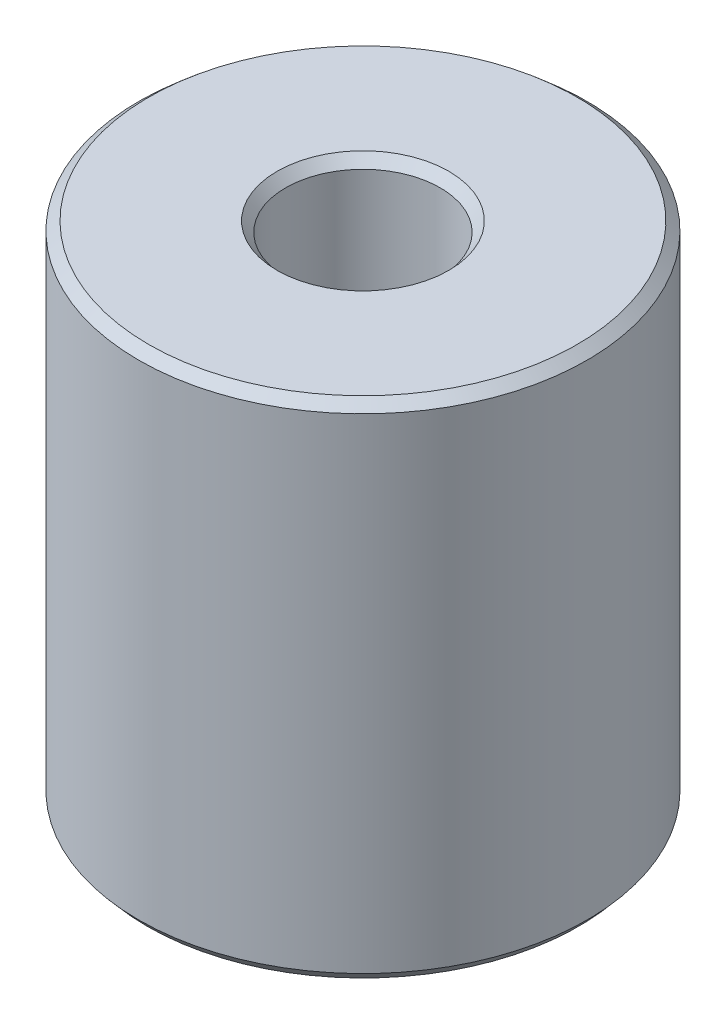
ISO-10303-21;
HEADER;
FILE_DESCRIPTION(('STEP AP214'),'2;1');
FILE_NAME('part.step','',(''),(''),'','','');
FILE_SCHEMA(('AUTOMOTIVE_DESIGN { 1 0 10303 214 1 1 1 1 }'));
ENDSEC;
DATA;
#1=APPLICATION_CONTEXT('core data for automotive mechanical design processes');
#2=APPLICATION_PROTOCOL_DEFINITION('international standard','automotive_design',2000,#1);
#3=PRODUCT_CONTEXT('',#1,'mechanical');
#4=PRODUCT('Part','Part','',(#3));
#5=PRODUCT_RELATED_PRODUCT_CATEGORY('part','',(#4));
#6=PRODUCT_DEFINITION_FORMATION('','',#4);
#7=PRODUCT_DEFINITION_CONTEXT('part definition',#1,'design');
#8=PRODUCT_DEFINITION('design','',#6,#7);
#9=PRODUCT_DEFINITION_SHAPE('','',#8);
#10=(LENGTH_UNIT() NAMED_UNIT(*) SI_UNIT(.MILLI.,.METRE.));
#11=(NAMED_UNIT(*) PLANE_ANGLE_UNIT() SI_UNIT($,.RADIAN.));
#12=(NAMED_UNIT(*) SI_UNIT($,.STERADIAN.) SOLID_ANGLE_UNIT());
#13=UNCERTAINTY_MEASURE_WITH_UNIT(LENGTH_MEASURE(1.E-05),#10,'distance_accuracy_value','');
#14=(GEOMETRIC_REPRESENTATION_CONTEXT(3) GLOBAL_UNCERTAINTY_ASSIGNED_CONTEXT((#13)) GLOBAL_UNIT_ASSIGNED_CONTEXT((#10,
#11,#12)) REPRESENTATION_CONTEXT('',''));
#15=CARTESIAN_POINT('',(0.,0.,0.));
#16=DIRECTION('',(0.,0.,1.));
#17=DIRECTION('',(1.,0.,0.));
#18=AXIS2_PLACEMENT_3D('',#15,#16,#17);
#19=CARTESIAN_POINT('',(0.,16.8402044351258,0.));
#20=DIRECTION('',(0.,-1.,0.));
#21=DIRECTION('',(0.,0.,-1.));
#22=AXIS2_PLACEMENT_3D('',#19,#20,#21);
#23=CYLINDRICAL_SURFACE('',#22,7.5);
#24=CARTESIAN_POINT('',(0.,0.332812918078715,0.));
#25=DIRECTION('',(0.,1.,0.));
#26=DIRECTION('',(0.,0.,1.));
#27=AXIS2_PLACEMENT_3D('',#24,#25,#26);
#28=CIRCLE('',#27,7.5);
#29=CARTESIAN_POINT('',(0.,0.332812918078715,7.5));
#30=VERTEX_POINT('',#29);
#31=EDGE_CURVE('E10',#30,#30,#28,.T.);
#32=ORIENTED_EDGE('',*,*,#31,.T.);
#33=EDGE_LOOP('',(#32));
#34=FACE_BOUND('',#33,.T.);
#35=CARTESIAN_POINT('',(0.,16.5516726464599,0.));
#36=DIRECTION('',(0.,1.,0.));
#37=DIRECTION('',(0.,0.,1.));
#38=AXIS2_PLACEMENT_3D('',#35,#36,#37);
#39=CIRCLE('',#38,7.5);
#40=CARTESIAN_POINT('',(0.,16.5516726464599,7.5));
#41=VERTEX_POINT('',#40);
#42=EDGE_CURVE('E50',#41,#41,#39,.F.);
#43=ORIENTED_EDGE('',*,*,#42,.T.);
#44=EDGE_LOOP('',(#43));
#45=FACE_BOUND('',#44,.T.);
#46=ADVANCED_FACE('F39',(#34,#45),#23,.T.);
#47=CARTESIAN_POINT('',(0.,16.8402044351258,0.));
#48=DIRECTION('',(0.,1.,0.));
#49=DIRECTION('',(0.,0.,1.));
#50=AXIS2_PLACEMENT_3D('',#47,#48,#49);
#51=PLANE('',#50);
#52=CARTESIAN_POINT('',(0.,16.8402044351258,0.));
#53=DIRECTION('',(0.,1.,0.));
#54=DIRECTION('',(0.,0.,1.));
#55=AXIS2_PLACEMENT_3D('',#52,#53,#54);
#56=CIRCLE('',#55,2.87287557769245);
#57=CARTESIAN_POINT('',(0.,16.8402044351258,2.87287557769245));
#58=VERTEX_POINT('',#57);
#59=EDGE_CURVE('E58',#58,#58,#56,.F.);
#60=ORIENTED_EDGE('',*,*,#59,.T.);
#61=EDGE_LOOP('',(#60));
#62=FACE_BOUND('',#61,.T.);
#63=CARTESIAN_POINT('',(0.,16.8402044351258,0.));
#64=DIRECTION('',(0.,1.,0.));
#65=DIRECTION('',(0.,0.,1.));
#66=AXIS2_PLACEMENT_3D('',#63,#64,#65);
#67=CIRCLE('',#66,7.16718708192129);
#68=CARTESIAN_POINT('',(0.,16.8402044351258,7.16718708192129));
#69=VERTEX_POINT('',#68);
#70=EDGE_CURVE('E61',#69,#69,#67,.T.);
#71=ORIENTED_EDGE('',*,*,#70,.T.);
#72=EDGE_LOOP('',(#71));
#73=FACE_BOUND('',#72,.T.);
#74=ADVANCED_FACE('F88',(#62,#73),#51,.T.);
#75=CARTESIAN_POINT('',(0.,0.,0.));
#76=DIRECTION('',(0.,1.,0.));
#77=DIRECTION('',(0.,0.,1.));
#78=AXIS2_PLACEMENT_3D('',#75,#76,#77);
#79=PLANE('',#78);
#80=CARTESIAN_POINT('',(0.,0.,0.));
#81=DIRECTION('',(0.,1.,0.));
#82=DIRECTION('',(0.,0.,1.));
#83=AXIS2_PLACEMENT_3D('',#80,#81,#82);
#84=CIRCLE('',#83,2.91715670710527);
#85=CARTESIAN_POINT('',(0.,0.,2.91715670710527));
#86=VERTEX_POINT('',#85);
#87=EDGE_CURVE('E51',#86,#86,#84,.T.);
#88=ORIENTED_EDGE('',*,*,#87,.T.);
#89=EDGE_LOOP('',(#88));
#90=FACE_BOUND('',#89,.T.);
#91=CARTESIAN_POINT('',(0.,0.,0.));
#92=DIRECTION('',(0.,1.,0.));
#93=DIRECTION('',(0.,0.,1.));
#94=AXIS2_PLACEMENT_3D('',#91,#92,#93);
#95=CIRCLE('',#94,7.21146821133411);
#96=CARTESIAN_POINT('',(0.,0.,7.21146821133411));
#97=VERTEX_POINT('',#96);
#98=EDGE_CURVE('E54',#97,#97,#95,.F.);
#99=ORIENTED_EDGE('',*,*,#98,.T.);
#100=EDGE_LOOP('',(#99));
#101=FACE_BOUND('',#100,.T.);
#102=ADVANCED_FACE('F83',(#90,#101),#79,.F.);
#103=CARTESIAN_POINT('',(0.,16.8402044351258,0.));
#104=DIRECTION('',(0.,-1.,0.));
#105=DIRECTION('',(0.,0.,-1.));
#106=AXIS2_PLACEMENT_3D('',#103,#104,#105);
#107=CYLINDRICAL_SURFACE('',#106,2.58434378902656);
#108=CARTESIAN_POINT('',(0.,16.5073915170471,0.));
#109=DIRECTION('',(0.,1.,0.));
#110=DIRECTION('',(0.,0.,1.));
#111=AXIS2_PLACEMENT_3D('',#108,#109,#110);
#112=CIRCLE('',#111,2.58434378902656);
#113=CARTESIAN_POINT('',(0.,16.5073915170471,2.58434378902656));
#114=VERTEX_POINT('',#113);
#115=EDGE_CURVE('E67',#114,#114,#112,.T.);
#116=ORIENTED_EDGE('',*,*,#115,.T.);
#117=EDGE_LOOP('',(#116));
#118=FACE_BOUND('',#117,.T.);
#119=CARTESIAN_POINT('',(0.,0.288531788665895,0.));
#120=DIRECTION('',(0.,1.,0.));
#121=DIRECTION('',(0.,0.,1.));
#122=AXIS2_PLACEMENT_3D('',#119,#120,#121);
#123=CIRCLE('',#122,2.58434378902656);
#124=CARTESIAN_POINT('',(0.,0.288531788665895,2.58434378902656));
#125=VERTEX_POINT('',#124);
#126=EDGE_CURVE('E69',#125,#125,#123,.F.);
#127=ORIENTED_EDGE('',*,*,#126,.T.);
#128=EDGE_LOOP('',(#127));
#129=FACE_BOUND('',#128,.T.);
#130=ADVANCED_FACE('F71',(#118,#129),#107,.F.);
#131=CARTESIAN_POINT('',(0.,16.5073915170471,0.));
#132=DIRECTION('',(0.,1.,0.));
#133=DIRECTION('',(0.,0.,1.));
#134=AXIS2_PLACEMENT_3D('',#131,#132,#133);
#135=CONICAL_SURFACE('',#134,2.58434378902656,0.714251842122027);
#136=ORIENTED_EDGE('',*,*,#59,.F.);
#137=EDGE_LOOP('',(#136));
#138=FACE_BOUND('',#137,.T.);
#139=ORIENTED_EDGE('',*,*,#115,.F.);
#140=EDGE_LOOP('',(#139));
#141=FACE_BOUND('',#140,.T.);
#142=ADVANCED_FACE('F77',(#138,#141),#135,.F.);
#143=CARTESIAN_POINT('',(0.,0.,0.));
#144=DIRECTION('',(0.,-1.,0.));
#145=DIRECTION('',(0.,0.,-1.));
#146=AXIS2_PLACEMENT_3D('',#143,#144,#145);
#147=CONICAL_SURFACE('',#146,2.91715670710527,0.856544484672868);
#148=ORIENTED_EDGE('',*,*,#126,.F.);
#149=EDGE_LOOP('',(#148));
#150=FACE_BOUND('',#149,.T.);
#151=ORIENTED_EDGE('',*,*,#87,.F.);
#152=EDGE_LOOP('',(#151));
#153=FACE_BOUND('',#152,.T.);
#154=ADVANCED_FACE('F73',(#150,#153),#147,.F.);
#155=CARTESIAN_POINT('',(0.,0.332812918078715,0.));
#156=DIRECTION('',(0.,1.,0.));
#157=DIRECTION('',(0.,0.,1.));
#158=AXIS2_PLACEMENT_3D('',#155,#156,#157);
#159=CONICAL_SURFACE('',#158,7.5,0.714251842122019);
#160=CARTESIAN_POINT('',(0.,0.,7.21146821133411));
#161=CARTESIAN_POINT('',(0.,0.00346680122998656,7.21447375079938));
#162=CARTESIAN_POINT('',(0.,0.00693360245997319,7.21747929026465));
#163=CARTESIAN_POINT('',(0.,0.0138672049199464,7.22349036919518));
#164=CARTESIAN_POINT('',(0.,0.017334006149933,7.22649590866045));
#165=CARTESIAN_POINT('',(0.,0.0242676086099063,7.23250698759099));
#166=CARTESIAN_POINT('',(0.,0.0277344098398929,7.23551252705626));
#167=CARTESIAN_POINT('',(0.,0.0346680122998662,7.2415236059868));
#168=CARTESIAN_POINT('',(0.,0.0381348135298528,7.24452914545207));
#169=CARTESIAN_POINT('',(0.,0.045068415989826,7.25054022438261));
#170=CARTESIAN_POINT('',(0.,0.0485352172198126,7.25354576384788));
#171=CARTESIAN_POINT('',(0.,0.0554688196797859,7.25955684277842));
#172=CARTESIAN_POINT('',(0.,0.0589356209097726,7.26256238224369));
#173=CARTESIAN_POINT('',(0.,0.0658692233697458,7.26857346117423));
#174=CARTESIAN_POINT('',(0.,0.0693360245997323,7.2715790006395));
#175=CARTESIAN_POINT('',(0.,0.0762696270597055,7.27759007957004));
#176=CARTESIAN_POINT('',(0.,0.0797364282896922,7.28059561903531));
#177=CARTESIAN_POINT('',(0.,0.0866700307496655,7.28660669796585));
#178=CARTESIAN_POINT('',(0.,0.0901368319796521,7.28961223743112));
#179=CARTESIAN_POINT('',(0.,0.0970704344396253,7.29562331636166));
#180=CARTESIAN_POINT('',(0.,0.100537235669612,7.29862885582693));
#181=CARTESIAN_POINT('',(0.,0.107470838129585,7.30463993475747));
#182=CARTESIAN_POINT('',(0.,0.110937639359572,7.30764547422274));
#183=CARTESIAN_POINT('',(0.,0.117871241819545,7.31365655315328));
#184=CARTESIAN_POINT('',(0.,0.121338043049532,7.31666209261855));
#185=CARTESIAN_POINT('',(0.,0.128271645509505,7.32267317154909));
#186=CARTESIAN_POINT('',(0.,0.131738446739492,7.32567871101436));
#187=CARTESIAN_POINT('',(0.,0.138672049199465,7.3316897899449));
#188=CARTESIAN_POINT('',(0.,0.142138850429451,7.33469532941016));
#189=CARTESIAN_POINT('',(0.,0.149072452889425,7.3407064083407));
#190=CARTESIAN_POINT('',(0.,0.152539254119411,7.34371194780597));
#191=CARTESIAN_POINT('',(0.,0.159472856579384,7.34972302673651));
#192=CARTESIAN_POINT('',(0.,0.162939657809371,7.35272856620178));
#193=CARTESIAN_POINT('',(0.,0.169873260269344,7.35873964513232));
#194=CARTESIAN_POINT('',(0.,0.173340061499331,7.36174518459759));
#195=CARTESIAN_POINT('',(0.,0.180273663959304,7.36775626352813));
#196=CARTESIAN_POINT('',(0.,0.183740465189291,7.3707618029934));
#197=CARTESIAN_POINT('',(0.,0.190674067649264,7.37677288192394));
#198=CARTESIAN_POINT('',(0.,0.194140868879251,7.37977842138921));
#199=CARTESIAN_POINT('',(0.,0.201074471339224,7.38578950031975));
#200=CARTESIAN_POINT('',(0.,0.204541272569211,7.38879503978502));
#201=CARTESIAN_POINT('',(0.,0.211474875029184,7.39480611871556));
#202=CARTESIAN_POINT('',(0.,0.21494167625917,7.39781165818083));
#203=CARTESIAN_POINT('',(0.,0.221875278719144,7.40382273711137));
#204=CARTESIAN_POINT('',(0.,0.22534207994913,7.40682827657664));
#205=CARTESIAN_POINT('',(0.,0.232275682409103,7.41283935550718));
#206=CARTESIAN_POINT('',(0.,0.23574248363909,7.41584489497245));
#207=CARTESIAN_POINT('',(0.,0.242676086099063,7.42185597390299));
#208=CARTESIAN_POINT('',(0.,0.24614288732905,7.42486151336826));
#209=CARTESIAN_POINT('',(0.,0.253076489789023,7.4308725922988));
#210=CARTESIAN_POINT('',(0.,0.25654329101901,7.43387813176407));
#211=CARTESIAN_POINT('',(0.,0.263476893478983,7.4398892106946));
#212=CARTESIAN_POINT('',(0.,0.26694369470897,7.44289475015987));
#213=CARTESIAN_POINT('',(0.,0.273877297168943,7.44890582909041));
#214=CARTESIAN_POINT('',(0.,0.27734409839893,7.45191136855568));
#215=CARTESIAN_POINT('',(0.,0.284277700858903,7.45792244748622));
#216=CARTESIAN_POINT('',(0.,0.287744502088889,7.46092798695149));
#217=CARTESIAN_POINT('',(0.,0.294678104548863,7.46693906588203));
#218=CARTESIAN_POINT('',(0.,0.298144905778849,7.4699446053473));
#219=CARTESIAN_POINT('',(0.,0.305078508238823,7.47595568427784));
#220=CARTESIAN_POINT('',(0.,0.308545309468809,7.47896122374311));
#221=CARTESIAN_POINT('',(0.,0.315478911928782,7.48497230267365));
#222=CARTESIAN_POINT('',(0.,0.318945713158769,7.48797784213892));
#223=CARTESIAN_POINT('',(0.,0.325879315618742,7.49398892106946));
#224=CARTESIAN_POINT('',(0.,0.329346116848729,7.49699446053473));
#225=CARTESIAN_POINT('',(0.,0.332812918078715,7.5));
#226=B_SPLINE_CURVE_WITH_KNOTS('',3,(#160,#161,#162,#163,#164,#165,#166,#167,#168,#169,#170,
#171,#172,#173,#174,#175,#176,#177,#178,#179,#180,#181,#182,#183,#184,#185,#186,#187,#188,#189,
#190,#191,#192,#193,#194,#195,#196,#197,#198,#199,#200,#201,#202,#203,#204,#205,#206,#207,#208,
#209,#210,#211,#212,#213,#214,#215,#216,#217,#218,#219,#220,#221,#222,#223,#224,#225),
.UNSPECIFIED.,.F.,.F.,(4,2,2,2,2,2,2,2,2,2,2,2,2,2,2,2,2,2,2,2,2,2,2,2,2,2,2,2,2,2,2,2,4),(0.,
0.013764730444501,0.0275294608890021,0.0412941913335031,0.0550589217780041,0.0688236522225052,
0.0825883826670062,0.0963531131115078,0.110117843556009,0.12388257400051,0.137647304445011,
0.151412034889512,0.165176765334013,0.178941495778514,0.192706226223015,0.206470956667516,
0.220235687112017,0.234000417556519,0.24776514800102,0.261529878445521,0.275294608890022,
0.289059339334523,0.302824069779024,0.316588800223525,0.330353530668026,0.344118261112527,
0.357882991557028,0.371647722001529,0.385412452446031,0.399177182890532,0.412941913335033,
0.426706643779534,0.440471374224035),.UNSPECIFIED.);
#227=EDGE_CURVE('BSEAM76',#97,#30,#226,.T.);
#228=ORIENTED_EDGE('',*,*,#98,.F.);
#229=ORIENTED_EDGE('',*,*,#31,.F.);
#230=ORIENTED_EDGE('',*,*,#227,.T.);
#231=ORIENTED_EDGE('',*,*,#227,.F.);
#232=EDGE_LOOP('',(#228,#230,#229,#231));
#233=FACE_BOUND('',#232,.T.);
#234=ADVANCED_FACE('F76',(#233),#159,.T.);
#235=CARTESIAN_POINT('',(0.,16.8402044351258,0.));
#236=DIRECTION('',(0.,-1.,0.));
#237=DIRECTION('',(0.,0.,-1.));
#238=AXIS2_PLACEMENT_3D('',#235,#236,#237);
#239=CONICAL_SURFACE('',#238,7.16718708192129,0.856544484672871);
#240=ORIENTED_EDGE('',*,*,#42,.F.);
#241=EDGE_LOOP('',(#240));
#242=FACE_BOUND('',#241,.T.);
#243=ORIENTED_EDGE('',*,*,#70,.F.);
#244=EDGE_LOOP('',(#243));
#245=FACE_BOUND('',#244,.T.);
#246=ADVANCED_FACE('F45',(#242,#245),#239,.T.);
#247=CLOSED_SHELL('',(#46,#74,#102,#130,#142,#154,#234,#246));
#248=MANIFOLD_SOLID_BREP('B2',#247);
#249=ADVANCED_BREP_SHAPE_REPRESENTATION('',(#18,#248),#14);
#250=SHAPE_DEFINITION_REPRESENTATION(#9,#249);
ENDSEC;
END-ISO-10303-21;
